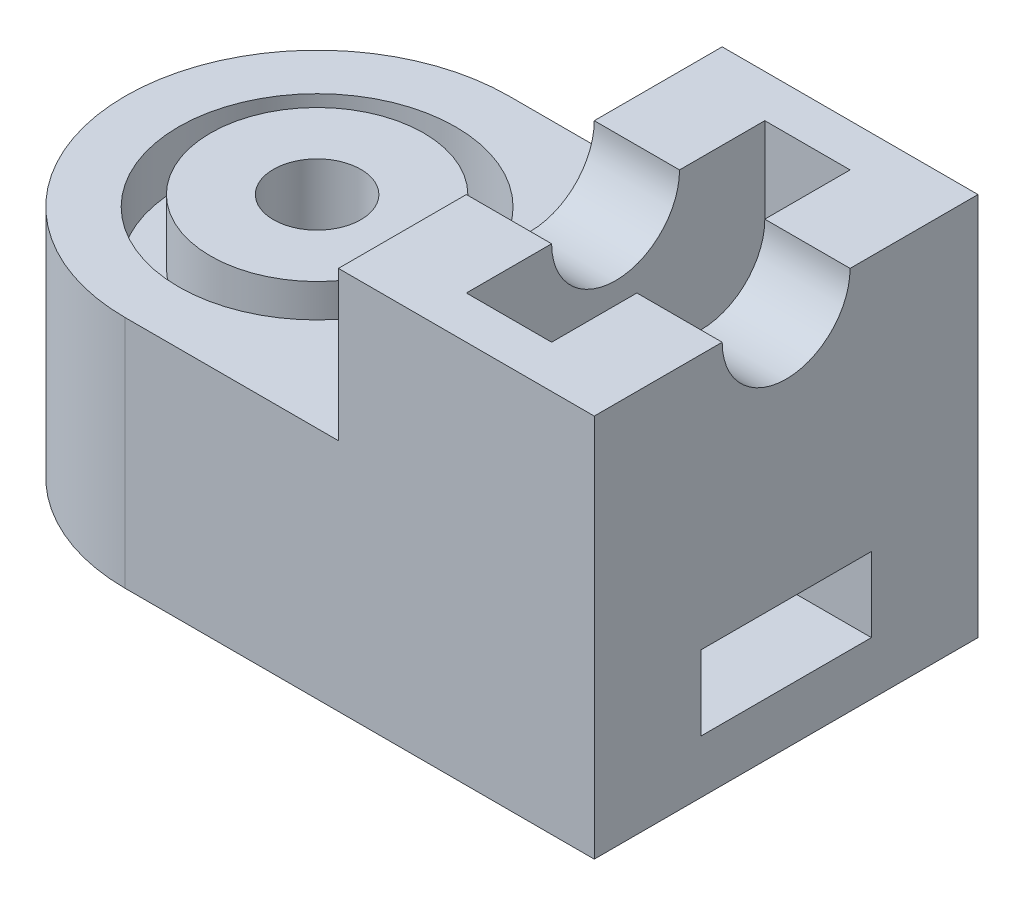
ISO-10303-21;
HEADER;
FILE_DESCRIPTION(('STEP AP214'),'2;1');
FILE_NAME('part.step','',(''),(''),'','','');
FILE_SCHEMA(('AUTOMOTIVE_DESIGN { 1 0 10303 214 1 1 1 1 }'));
ENDSEC;
DATA;
#1=APPLICATION_CONTEXT('core data for automotive mechanical design processes');
#2=APPLICATION_PROTOCOL_DEFINITION('international standard','automotive_design',2000,#1);
#3=PRODUCT_CONTEXT('',#1,'mechanical');
#4=PRODUCT('Part','Part','',(#3));
#5=PRODUCT_RELATED_PRODUCT_CATEGORY('part','',(#4));
#6=PRODUCT_DEFINITION_FORMATION('','',#4);
#7=PRODUCT_DEFINITION_CONTEXT('part definition',#1,'design');
#8=PRODUCT_DEFINITION('design','',#6,#7);
#9=PRODUCT_DEFINITION_SHAPE('','',#8);
#10=(LENGTH_UNIT() NAMED_UNIT(*) SI_UNIT(.MILLI.,.METRE.));
#11=(NAMED_UNIT(*) PLANE_ANGLE_UNIT() SI_UNIT($,.RADIAN.));
#12=(NAMED_UNIT(*) SI_UNIT($,.STERADIAN.) SOLID_ANGLE_UNIT());
#13=UNCERTAINTY_MEASURE_WITH_UNIT(LENGTH_MEASURE(1.E-05),#10,'distance_accuracy_value','');
#14=(GEOMETRIC_REPRESENTATION_CONTEXT(3) GLOBAL_UNCERTAINTY_ASSIGNED_CONTEXT((#13)) GLOBAL_UNIT_ASSIGNED_CONTEXT((#10,
#11,#12)) REPRESENTATION_CONTEXT('',''));
#15=CARTESIAN_POINT('',(0.,0.,0.));
#16=DIRECTION('',(0.,0.,1.));
#17=DIRECTION('',(1.,0.,0.));
#18=AXIS2_PLACEMENT_3D('',#15,#16,#17);
#19=CARTESIAN_POINT('',(-5.5,9.,0.));
#20=DIRECTION('',(0.,-1.,0.));
#21=DIRECTION('',(0.,0.,-1.));
#22=AXIS2_PLACEMENT_3D('',#19,#20,#21);
#23=CYLINDRICAL_SURFACE('',#22,4.5);
#24=DIRECTION('',(0.,-1.,0.));
#25=VECTOR('',#24,1.);
#26=CARTESIAN_POINT('',(-5.5,9.,4.5));
#27=LINE('',#26,#25);
#28=CARTESIAN_POINT('',(-5.5,5.5,4.5));
#29=VERTEX_POINT('',#28);
#30=CARTESIAN_POINT('',(-5.5,0.,4.5));
#31=VERTEX_POINT('',#30);
#32=EDGE_CURVE('E390',#29,#31,#27,.T.);
#33=ORIENTED_EDGE('',*,*,#32,.F.);
#34=CARTESIAN_POINT('',(-5.5,5.5,0.));
#35=DIRECTION('',(0.,-1.,0.));
#36=DIRECTION('',(0.,0.,-1.));
#37=AXIS2_PLACEMENT_3D('',#34,#35,#36);
#38=CIRCLE('',#37,4.5);
#39=CARTESIAN_POINT('',(-5.5,5.5,-4.5));
#40=VERTEX_POINT('',#39);
#41=EDGE_CURVE('E360',#29,#40,#38,.T.);
#42=ORIENTED_EDGE('',*,*,#41,.T.);
#43=DIRECTION('',(0.,-1.,0.));
#44=VECTOR('',#43,1.);
#45=CARTESIAN_POINT('',(-5.5,9.,-4.5));
#46=LINE('',#45,#44);
#47=CARTESIAN_POINT('',(-5.5,0.,-4.5));
#48=VERTEX_POINT('',#47);
#49=EDGE_CURVE('E374',#40,#48,#46,.T.);
#50=ORIENTED_EDGE('',*,*,#49,.T.);
#51=CARTESIAN_POINT('',(-5.5,0.,0.));
#52=DIRECTION('',(0.,1.,0.));
#53=DIRECTION('',(0.,0.,1.));
#54=AXIS2_PLACEMENT_3D('',#51,#52,#53);
#55=CIRCLE('',#54,4.5);
#56=EDGE_CURVE('E363',#48,#31,#55,.T.);
#57=ORIENTED_EDGE('',*,*,#56,.T.);
#58=EDGE_LOOP('',(#33,#42,#50,#57));
#59=FACE_BOUND('',#58,.T.);
#60=CARTESIAN_POINT('',(-5.5,0.750000000000001,0.));
#61=DIRECTION('',(0.,1.,0.));
#62=DIRECTION('',(0.,0.,1.));
#63=AXIS2_PLACEMENT_3D('',#60,#61,#62);
#64=CIRCLE('',#63,4.5);
#65=CARTESIAN_POINT('',(-8.85410196624968,0.75,-3.));
#66=VERTEX_POINT('',#65);
#67=CARTESIAN_POINT('',(-8.85410196624968,0.750000000000001,3.));
#68=VERTEX_POINT('',#67);
#69=EDGE_CURVE('E422',#66,#68,#64,.T.);
#70=ORIENTED_EDGE('',*,*,#69,.F.);
#71=DIRECTION('',(0.,-1.,0.));
#72=VECTOR('',#71,1.);
#73=CARTESIAN_POINT('',(-8.85410196624968,9.,-3.));
#74=LINE('',#73,#72);
#75=CARTESIAN_POINT('',(-8.85410196624968,3.5,-3.));
#76=VERTEX_POINT('',#75);
#77=EDGE_CURVE('E42',#76,#66,#74,.T.);
#78=ORIENTED_EDGE('',*,*,#77,.F.);
#79=CARTESIAN_POINT('',(-5.5,3.5,0.));
#80=DIRECTION('',(0.,-1.,0.));
#81=DIRECTION('',(0.,0.,-1.));
#82=AXIS2_PLACEMENT_3D('',#79,#80,#81);
#83=CIRCLE('',#82,4.5);
#84=CARTESIAN_POINT('',(-8.85410196624968,3.5,3.));
#85=VERTEX_POINT('',#84);
#86=EDGE_CURVE('E426',#85,#76,#83,.T.);
#87=ORIENTED_EDGE('',*,*,#86,.F.);
#88=DIRECTION('',(0.,-1.,0.));
#89=VECTOR('',#88,1.);
#90=CARTESIAN_POINT('',(-8.85410196624968,9.,3.));
#91=LINE('',#90,#89);
#92=EDGE_CURVE('E424',#68,#85,#91,.F.);
#93=ORIENTED_EDGE('',*,*,#92,.F.);
#94=EDGE_LOOP('',(#70,#78,#87,#93));
#95=FACE_BOUND('',#94,.T.);
#96=ADVANCED_FACE('F35',(#59,#95),#23,.T.);
#97=CARTESIAN_POINT('',(-16.,3.,-2.));
#98=DIRECTION('',(0.,1.,0.));
#99=DIRECTION('',(0.,0.,1.));
#100=AXIS2_PLACEMENT_3D('',#97,#98,#99);
#101=PLANE('',#100);
#102=DIRECTION('',(1.,0.,0.));
#103=VECTOR('',#102,1.);
#104=CARTESIAN_POINT('',(-16.,3.,-2.));
#105=LINE('',#104,#103);
#106=CARTESIAN_POINT('',(-5.5,3.,-2.));
#107=VERTEX_POINT('',#106);
#108=CARTESIAN_POINT('',(1.5,3.,-2.));
#109=VERTEX_POINT('',#108);
#110=EDGE_CURVE('E280',#107,#109,#105,.T.);
#111=ORIENTED_EDGE('',*,*,#110,.T.);
#112=DIRECTION('',(0.,0.,-1.));
#113=VECTOR('',#112,1.);
#114=CARTESIAN_POINT('',(1.5,3.,-3.5));
#115=LINE('',#114,#113);
#116=CARTESIAN_POINT('',(1.5,3.,2.));
#117=VERTEX_POINT('',#116);
#118=EDGE_CURVE('E408',#117,#109,#115,.T.);
#119=ORIENTED_EDGE('',*,*,#118,.F.);
#120=DIRECTION('',(1.,0.,0.));
#121=VECTOR('',#120,1.);
#122=CARTESIAN_POINT('',(-16.,3.,2.));
#123=LINE('',#122,#121);
#124=CARTESIAN_POINT('',(-5.5,3.,2.));
#125=VERTEX_POINT('',#124);
#126=EDGE_CURVE('E277',#125,#117,#123,.T.);
#127=ORIENTED_EDGE('',*,*,#126,.F.);
#128=DIRECTION('',(0.,0.,1.));
#129=VECTOR('',#128,1.);
#130=CARTESIAN_POINT('',(-5.5,3.,-2.));
#131=LINE('',#130,#129);
#132=EDGE_CURVE('E257',#107,#125,#131,.T.);
#133=ORIENTED_EDGE('',*,*,#132,.F.);
#134=EDGE_LOOP('',(#111,#119,#127,#133));
#135=FACE_BOUND('',#134,.T.);
#136=ADVANCED_FACE('F442',(#135),#101,.F.);
#137=CARTESIAN_POINT('',(-16.,1.25,2.));
#138=DIRECTION('',(0.,0.,1.));
#139=DIRECTION('',(0.,-1.,0.));
#140=AXIS2_PLACEMENT_3D('',#137,#138,#139);
#141=PLANE('',#140);
#142=ORIENTED_EDGE('',*,*,#126,.T.);
#143=DIRECTION('',(0.,1.,0.));
#144=VECTOR('',#143,1.);
#145=CARTESIAN_POINT('',(1.5,-19.7739735867457,2.));
#146=LINE('',#145,#144);
#147=CARTESIAN_POINT('',(1.5,1.25,2.));
#148=VERTEX_POINT('',#147);
#149=EDGE_CURVE('E411',#148,#117,#146,.T.);
#150=ORIENTED_EDGE('',*,*,#149,.F.);
#151=DIRECTION('',(1.,0.,0.));
#152=VECTOR('',#151,1.);
#153=CARTESIAN_POINT('',(-16.,1.25,2.));
#154=LINE('',#153,#152);
#155=CARTESIAN_POINT('',(-5.5,1.25,2.));
#156=VERTEX_POINT('',#155);
#157=EDGE_CURVE('E274',#156,#148,#154,.T.);
#158=ORIENTED_EDGE('',*,*,#157,.F.);
#159=DIRECTION('',(0.,-1.,0.));
#160=VECTOR('',#159,1.);
#161=CARTESIAN_POINT('',(-5.5,1.25,2.));
#162=LINE('',#161,#160);
#163=EDGE_CURVE('E255',#125,#156,#162,.T.);
#164=ORIENTED_EDGE('',*,*,#163,.F.);
#165=EDGE_LOOP('',(#142,#150,#158,#164));
#166=FACE_BOUND('',#165,.T.);
#167=ADVANCED_FACE('F449',(#166),#141,.F.);
#168=CARTESIAN_POINT('',(-16.,1.25,-2.));
#169=DIRECTION('',(0.,-1.,0.));
#170=DIRECTION('',(0.,0.,-1.));
#171=AXIS2_PLACEMENT_3D('',#168,#169,#170);
#172=PLANE('',#171);
#173=ORIENTED_EDGE('',*,*,#157,.T.);
#174=DIRECTION('',(0.,0.,1.));
#175=VECTOR('',#174,1.);
#176=CARTESIAN_POINT('',(1.5,1.25,-3.5));
#177=LINE('',#176,#175);
#178=CARTESIAN_POINT('',(1.5,1.25,-2.));
#179=VERTEX_POINT('',#178);
#180=EDGE_CURVE('E414',#179,#148,#177,.T.);
#181=ORIENTED_EDGE('',*,*,#180,.F.);
#182=DIRECTION('',(1.,0.,0.));
#183=VECTOR('',#182,1.);
#184=CARTESIAN_POINT('',(-16.,1.25,-2.));
#185=LINE('',#184,#183);
#186=CARTESIAN_POINT('',(-5.5,1.25,-2.));
#187=VERTEX_POINT('',#186);
#188=EDGE_CURVE('E273',#187,#179,#185,.T.);
#189=ORIENTED_EDGE('',*,*,#188,.F.);
#190=DIRECTION('',(0.,0.,-1.));
#191=VECTOR('',#190,1.);
#192=CARTESIAN_POINT('',(-5.5,1.25,-2.));
#193=LINE('',#192,#191);
#194=EDGE_CURVE('E55',#156,#187,#193,.T.);
#195=ORIENTED_EDGE('',*,*,#194,.F.);
#196=EDGE_LOOP('',(#173,#181,#189,#195));
#197=FACE_BOUND('',#196,.T.);
#198=ADVANCED_FACE('F543',(#197),#172,.F.);
#199=CARTESIAN_POINT('',(-16.,1.25,-2.));
#200=DIRECTION('',(0.,0.,-1.));
#201=DIRECTION('',(0.,1.,0.));
#202=AXIS2_PLACEMENT_3D('',#199,#200,#201);
#203=PLANE('',#202);
#204=ORIENTED_EDGE('',*,*,#188,.T.);
#205=DIRECTION('',(0.,-1.,0.));
#206=VECTOR('',#205,1.);
#207=CARTESIAN_POINT('',(1.5,-19.7739735867457,-2.00000000000001));
#208=LINE('',#207,#206);
#209=EDGE_CURVE('E417',#109,#179,#208,.T.);
#210=ORIENTED_EDGE('',*,*,#209,.F.);
#211=ORIENTED_EDGE('',*,*,#110,.F.);
#212=DIRECTION('',(0.,1.,0.));
#213=VECTOR('',#212,1.);
#214=CARTESIAN_POINT('',(-5.5,1.25,-2.));
#215=LINE('',#214,#213);
#216=EDGE_CURVE('E420',#187,#107,#215,.T.);
#217=ORIENTED_EDGE('',*,*,#216,.F.);
#218=EDGE_LOOP('',(#204,#210,#211,#217));
#219=FACE_BOUND('',#218,.T.);
#220=ADVANCED_FACE('F539',(#219),#203,.F.);
#221=CARTESIAN_POINT('',(13.,9.,0.));
#222=DIRECTION('',(-1.,0.,0.));
#223=DIRECTION('',(0.,0.,1.));
#224=AXIS2_PLACEMENT_3D('',#221,#222,#223);
#225=CYLINDRICAL_SURFACE('',#224,1.5);
#226=DIRECTION('',(-1.,0.,0.));
#227=VECTOR('',#226,1.);
#228=CARTESIAN_POINT('',(13.,9.,-1.5));
#229=LINE('',#228,#227);
#230=CARTESIAN_POINT('',(5.5,9.,-1.5));
#231=VERTEX_POINT('',#230);
#232=CARTESIAN_POINT('',(3.5,9.,-1.5));
#233=VERTEX_POINT('',#232);
#234=EDGE_CURVE('E337',#231,#233,#229,.T.);
#235=ORIENTED_EDGE('',*,*,#234,.T.);
#236=CARTESIAN_POINT('',(3.5,9.,0.));
#237=DIRECTION('',(1.,0.,0.));
#238=DIRECTION('',(0.,0.,-1.));
#239=AXIS2_PLACEMENT_3D('',#236,#237,#238);
#240=CIRCLE('',#239,1.5);
#241=CARTESIAN_POINT('',(3.5,9.,1.5));
#242=VERTEX_POINT('',#241);
#243=EDGE_CURVE('E399',#233,#242,#240,.F.);
#244=ORIENTED_EDGE('',*,*,#243,.T.);
#245=DIRECTION('',(-1.,0.,0.));
#246=VECTOR('',#245,1.);
#247=CARTESIAN_POINT('',(13.,9.,1.5));
#248=LINE('',#247,#246);
#249=CARTESIAN_POINT('',(5.5,9.,1.5));
#250=VERTEX_POINT('',#249);
#251=EDGE_CURVE('E342',#250,#242,#248,.T.);
#252=ORIENTED_EDGE('',*,*,#251,.F.);
#253=CARTESIAN_POINT('',(5.5,9.,0.));
#254=DIRECTION('',(-1.,0.,0.));
#255=DIRECTION('',(0.,0.,1.));
#256=AXIS2_PLACEMENT_3D('',#253,#254,#255);
#257=CIRCLE('',#256,1.5);
#258=EDGE_CURVE('E340',#231,#250,#257,.T.);
#259=ORIENTED_EDGE('',*,*,#258,.F.);
#260=EDGE_LOOP('',(#235,#244,#252,#259));
#261=FACE_BOUND('',#260,.T.);
#262=ADVANCED_FACE('F494',(#261),#225,.F.);
#263=CARTESIAN_POINT('',(0.,9.,0.));
#264=DIRECTION('',(0.,1.,0.));
#265=DIRECTION('',(0.,0.,1.));
#266=AXIS2_PLACEMENT_3D('',#263,#264,#265);
#267=PLANE('',#266);
#268=DIRECTION('',(0.,0.,-1.));
#269=VECTOR('',#268,1.);
#270=CARTESIAN_POINT('',(3.5,9.,-3.5));
#271=LINE('',#270,#269);
#272=CARTESIAN_POINT('',(3.5,9.,-3.5));
#273=VERTEX_POINT('',#272);
#274=EDGE_CURVE('E305',#233,#273,#271,.T.);
#275=ORIENTED_EDGE('',*,*,#274,.F.);
#276=ORIENTED_EDGE('',*,*,#234,.F.);
#277=DIRECTION('',(0.,0.,-1.));
#278=VECTOR('',#277,1.);
#279=CARTESIAN_POINT('',(5.5,9.,0.));
#280=LINE('',#279,#278);
#281=CARTESIAN_POINT('',(5.5,9.,-4.5));
#282=VERTEX_POINT('',#281);
#283=EDGE_CURVE('E366',#231,#282,#280,.T.);
#284=ORIENTED_EDGE('',*,*,#283,.T.);
#285=DIRECTION('',(1.,0.,0.));
#286=VECTOR('',#285,1.);
#287=CARTESIAN_POINT('',(0.,9.,-4.5));
#288=LINE('',#287,#286);
#289=CARTESIAN_POINT('',(-0.500000000000002,9.,-4.5));
#290=VERTEX_POINT('',#289);
#291=EDGE_CURVE('E371',#290,#282,#288,.T.);
#292=ORIENTED_EDGE('',*,*,#291,.F.);
#293=DIRECTION('',(0.,0.,-1.));
#294=VECTOR('',#293,1.);
#295=CARTESIAN_POINT('',(-0.500000000000002,9.,0.));
#296=LINE('',#295,#294);
#297=CARTESIAN_POINT('',(-0.500000000000002,9.,-1.5));
#298=VERTEX_POINT('',#297);
#299=EDGE_CURVE('E392',#298,#290,#296,.T.);
#300=ORIENTED_EDGE('',*,*,#299,.F.);
#301=CARTESIAN_POINT('',(1.5,9.,-1.5));
#302=VERTEX_POINT('',#301);
#303=EDGE_CURVE('E341',#302,#298,#229,.T.);
#304=ORIENTED_EDGE('',*,*,#303,.F.);
#305=DIRECTION('',(0.,0.,1.));
#306=VECTOR('',#305,1.);
#307=CARTESIAN_POINT('',(1.5,9.,-3.5));
#308=LINE('',#307,#306);
#309=CARTESIAN_POINT('',(1.5,9.,-3.5));
#310=VERTEX_POINT('',#309);
#311=EDGE_CURVE('E314',#310,#302,#308,.T.);
#312=ORIENTED_EDGE('',*,*,#311,.F.);
#313=DIRECTION('',(-1.,0.,0.));
#314=VECTOR('',#313,1.);
#315=CARTESIAN_POINT('',(3.5,9.,-3.5));
#316=LINE('',#315,#314);
#317=EDGE_CURVE('E310',#273,#310,#316,.T.);
#318=ORIENTED_EDGE('',*,*,#317,.F.);
#319=EDGE_LOOP('',(#275,#276,#284,#292,#300,#304,#312,#318));
#320=FACE_BOUND('',#319,.T.);
#321=ADVANCED_FACE('F490',(#320),#267,.T.);
#322=CARTESIAN_POINT('',(0.,9.,4.5));
#323=DIRECTION('',(0.,0.,-1.));
#324=DIRECTION('',(-1.,0.,0.));
#325=AXIS2_PLACEMENT_3D('',#322,#323,#324);
#326=PLANE('',#325);
#327=DIRECTION('',(1.,0.,0.));
#328=VECTOR('',#327,1.);
#329=CARTESIAN_POINT('',(0.,9.,4.5));
#330=LINE('',#329,#328);
#331=CARTESIAN_POINT('',(-0.500000000000002,9.,4.5));
#332=VERTEX_POINT('',#331);
#333=CARTESIAN_POINT('',(5.5,9.,4.5));
#334=VERTEX_POINT('',#333);
#335=EDGE_CURVE('E364',#332,#334,#330,.T.);
#336=ORIENTED_EDGE('',*,*,#335,.F.);
#337=DIRECTION('',(0.,-1.,0.));
#338=VECTOR('',#337,1.);
#339=CARTESIAN_POINT('',(-0.500000000000001,9.,4.5));
#340=LINE('',#339,#338);
#341=CARTESIAN_POINT('',(-0.500000000000001,5.5,4.5));
#342=VERTEX_POINT('',#341);
#343=EDGE_CURVE('E354',#332,#342,#340,.T.);
#344=ORIENTED_EDGE('',*,*,#343,.T.);
#345=DIRECTION('',(-1.,0.,0.));
#346=VECTOR('',#345,1.);
#347=CARTESIAN_POINT('',(0.,5.5,4.5));
#348=LINE('',#347,#346);
#349=EDGE_CURVE('E357',#342,#29,#348,.T.);
#350=ORIENTED_EDGE('',*,*,#349,.T.);
#351=ORIENTED_EDGE('',*,*,#32,.T.);
#352=DIRECTION('',(1.,0.,0.));
#353=VECTOR('',#352,1.);
#354=CARTESIAN_POINT('',(0.,0.,4.5));
#355=LINE('',#354,#353);
#356=CARTESIAN_POINT('',(5.5,0.,4.5));
#357=VERTEX_POINT('',#356);
#358=EDGE_CURVE('E377',#31,#357,#355,.T.);
#359=ORIENTED_EDGE('',*,*,#358,.T.);
#360=DIRECTION('',(0.,-1.,0.));
#361=VECTOR('',#360,1.);
#362=CARTESIAN_POINT('',(5.5,9.,4.5));
#363=LINE('',#362,#361);
#364=EDGE_CURVE('E387',#334,#357,#363,.T.);
#365=ORIENTED_EDGE('',*,*,#364,.F.);
#366=EDGE_LOOP('',(#336,#344,#350,#351,#359,#365));
#367=FACE_BOUND('',#366,.T.);
#368=ADVANCED_FACE('F459',(#367),#326,.F.);
#369=CARTESIAN_POINT('',(5.5,9.,0.));
#370=DIRECTION('',(-1.,0.,0.));
#371=DIRECTION('',(0.,0.,1.));
#372=AXIS2_PLACEMENT_3D('',#369,#370,#371);
#373=PLANE('',#372);
#374=DIRECTION('',(0.,0.,1.));
#375=VECTOR('',#374,1.);
#376=CARTESIAN_POINT('',(5.5,3.,-2.));
#377=LINE('',#376,#375);
#378=CARTESIAN_POINT('',(5.5,3.,-2.));
#379=VERTEX_POINT('',#378);
#380=CARTESIAN_POINT('',(5.5,3.,2.));
#381=VERTEX_POINT('',#380);
#382=EDGE_CURVE('E261',#379,#381,#377,.T.);
#383=ORIENTED_EDGE('',*,*,#382,.F.);
#384=DIRECTION('',(0.,1.,0.));
#385=VECTOR('',#384,1.);
#386=CARTESIAN_POINT('',(5.5,1.25,-2.));
#387=LINE('',#386,#385);
#388=CARTESIAN_POINT('',(5.5,1.25,-2.));
#389=VERTEX_POINT('',#388);
#390=EDGE_CURVE('E259',#389,#379,#387,.T.);
#391=ORIENTED_EDGE('',*,*,#390,.F.);
#392=DIRECTION('',(0.,0.,-1.));
#393=VECTOR('',#392,1.);
#394=CARTESIAN_POINT('',(5.5,1.25,-2.));
#395=LINE('',#394,#393);
#396=CARTESIAN_POINT('',(5.5,1.25,2.));
#397=VERTEX_POINT('',#396);
#398=EDGE_CURVE('E267',#397,#389,#395,.T.);
#399=ORIENTED_EDGE('',*,*,#398,.F.);
#400=DIRECTION('',(0.,-1.,0.));
#401=VECTOR('',#400,1.);
#402=CARTESIAN_POINT('',(5.5,1.25,2.));
#403=LINE('',#402,#401);
#404=EDGE_CURVE('E264',#381,#397,#403,.T.);
#405=ORIENTED_EDGE('',*,*,#404,.F.);
#406=EDGE_LOOP('',(#383,#391,#399,#405));
#407=FACE_BOUND('',#406,.T.);
#408=ORIENTED_EDGE('',*,*,#283,.F.);
#409=ORIENTED_EDGE('',*,*,#258,.T.);
#410=EDGE_CURVE('E368',#334,#250,#280,.T.);
#411=ORIENTED_EDGE('',*,*,#410,.F.);
#412=ORIENTED_EDGE('',*,*,#364,.T.);
#413=DIRECTION('',(0.,0.,-1.));
#414=VECTOR('',#413,1.);
#415=CARTESIAN_POINT('',(5.5,0.,0.));
#416=LINE('',#415,#414);
#417=CARTESIAN_POINT('',(5.5,0.,-4.5));
#418=VERTEX_POINT('',#417);
#419=EDGE_CURVE('E379',#357,#418,#416,.T.);
#420=ORIENTED_EDGE('',*,*,#419,.T.);
#421=DIRECTION('',(0.,-1.,0.));
#422=VECTOR('',#421,1.);
#423=CARTESIAN_POINT('',(5.5,9.,-4.5));
#424=LINE('',#423,#422);
#425=EDGE_CURVE('E385',#282,#418,#424,.T.);
#426=ORIENTED_EDGE('',*,*,#425,.F.);
#427=EDGE_LOOP('',(#408,#409,#411,#412,#420,#426));
#428=FACE_BOUND('',#427,.T.);
#429=ADVANCED_FACE('F468',(#407,#428),#373,.F.);
#430=CARTESIAN_POINT('',(0.,9.,-4.5));
#431=DIRECTION('',(0.,0.,-1.));
#432=DIRECTION('',(-1.,0.,0.));
#433=AXIS2_PLACEMENT_3D('',#430,#431,#432);
#434=PLANE('',#433);
#435=DIRECTION('',(0.,1.,0.));
#436=VECTOR('',#435,1.);
#437=CARTESIAN_POINT('',(-0.500000000000002,5.5,-4.5));
#438=LINE('',#437,#436);
#439=CARTESIAN_POINT('',(-0.500000000000002,5.5,-4.5));
#440=VERTEX_POINT('',#439);
#441=EDGE_CURVE('E351',#440,#290,#438,.T.);
#442=ORIENTED_EDGE('',*,*,#441,.T.);
#443=ORIENTED_EDGE('',*,*,#291,.T.);
#444=ORIENTED_EDGE('',*,*,#425,.T.);
#445=DIRECTION('',(1.,0.,0.));
#446=VECTOR('',#445,1.);
#447=CARTESIAN_POINT('',(0.,0.,-4.5));
#448=LINE('',#447,#446);
#449=EDGE_CURVE('E367',#48,#418,#448,.T.);
#450=ORIENTED_EDGE('',*,*,#449,.F.);
#451=ORIENTED_EDGE('',*,*,#49,.F.);
#452=DIRECTION('',(-1.,0.,0.));
#453=VECTOR('',#452,1.);
#454=CARTESIAN_POINT('',(-0.500000000000002,5.5,-4.5));
#455=LINE('',#454,#453);
#456=EDGE_CURVE('E349',#440,#40,#455,.T.);
#457=ORIENTED_EDGE('',*,*,#456,.F.);
#458=EDGE_LOOP('',(#442,#443,#444,#450,#451,#457));
#459=FACE_BOUND('',#458,.T.);
#460=ADVANCED_FACE('F486',(#459),#434,.T.);
#461=CARTESIAN_POINT('',(3.5,9.,3.5));
#462=VERTEX_POINT('',#461);
#463=EDGE_CURVE('E308',#462,#242,#271,.T.);
#464=ORIENTED_EDGE('',*,*,#463,.F.);
#465=DIRECTION('',(1.,0.,0.));
#466=VECTOR('',#465,1.);
#467=CARTESIAN_POINT('',(3.5,9.,3.5));
#468=LINE('',#467,#466);
#469=CARTESIAN_POINT('',(1.5,9.,3.5));
#470=VERTEX_POINT('',#469);
#471=EDGE_CURVE('E316',#470,#462,#468,.T.);
#472=ORIENTED_EDGE('',*,*,#471,.F.);
#473=CARTESIAN_POINT('',(1.5,9.,1.5));
#474=VERTEX_POINT('',#473);
#475=EDGE_CURVE('E313',#474,#470,#308,.T.);
#476=ORIENTED_EDGE('',*,*,#475,.F.);
#477=CARTESIAN_POINT('',(-0.500000000000001,9.,1.5));
#478=VERTEX_POINT('',#477);
#479=EDGE_CURVE('E336',#474,#478,#248,.T.);
#480=ORIENTED_EDGE('',*,*,#479,.T.);
#481=EDGE_CURVE('E393',#332,#478,#296,.T.);
#482=ORIENTED_EDGE('',*,*,#481,.F.);
#483=ORIENTED_EDGE('',*,*,#335,.T.);
#484=ORIENTED_EDGE('',*,*,#410,.T.);
#485=ORIENTED_EDGE('',*,*,#251,.T.);
#486=EDGE_LOOP('',(#464,#472,#476,#480,#482,#483,#484,#485));
#487=FACE_BOUND('',#486,.T.);
#488=ADVANCED_FACE('F473',(#487),#267,.T.);
#489=CARTESIAN_POINT('',(0.,0.,0.));
#490=DIRECTION('',(0.,1.,0.));
#491=DIRECTION('',(0.,0.,1.));
#492=AXIS2_PLACEMENT_3D('',#489,#490,#491);
#493=PLANE('',#492);
#494=DIRECTION('',(1.,0.,0.));
#495=VECTOR('',#494,1.);
#496=CARTESIAN_POINT('',(0.,0.,3.5));
#497=LINE('',#496,#495);
#498=CARTESIAN_POINT('',(1.5,0.,3.5));
#499=VERTEX_POINT('',#498);
#500=CARTESIAN_POINT('',(3.5,0.,3.5));
#501=VERTEX_POINT('',#500);
#502=EDGE_CURVE('E405',#499,#501,#497,.T.);
#503=ORIENTED_EDGE('',*,*,#502,.T.);
#504=DIRECTION('',(0.,0.,-1.));
#505=VECTOR('',#504,1.);
#506=CARTESIAN_POINT('',(3.5,0.,0.));
#507=LINE('',#506,#505);
#508=CARTESIAN_POINT('',(3.5,0.,-3.5));
#509=VERTEX_POINT('',#508);
#510=EDGE_CURVE('E330',#501,#509,#507,.T.);
#511=ORIENTED_EDGE('',*,*,#510,.T.);
#512=DIRECTION('',(-1.,0.,0.));
#513=VECTOR('',#512,1.);
#514=CARTESIAN_POINT('',(0.,0.,-3.5));
#515=LINE('',#514,#513);
#516=CARTESIAN_POINT('',(1.5,0.,-3.5));
#517=VERTEX_POINT('',#516);
#518=EDGE_CURVE('E402',#509,#517,#515,.T.);
#519=ORIENTED_EDGE('',*,*,#518,.T.);
#520=DIRECTION('',(0.,0.,1.));
#521=VECTOR('',#520,1.);
#522=CARTESIAN_POINT('',(1.5,0.,0.));
#523=LINE('',#522,#521);
#524=EDGE_CURVE('E322',#517,#499,#523,.T.);
#525=ORIENTED_EDGE('',*,*,#524,.T.);
#526=EDGE_LOOP('',(#503,#511,#519,#525));
#527=FACE_BOUND('',#526,.T.);
#528=ORIENTED_EDGE('',*,*,#56,.F.);
#529=ORIENTED_EDGE('',*,*,#449,.T.);
#530=ORIENTED_EDGE('',*,*,#419,.F.);
#531=ORIENTED_EDGE('',*,*,#358,.F.);
#532=EDGE_LOOP('',(#528,#529,#530,#531));
#533=FACE_BOUND('',#532,.T.);
#534=ADVANCED_FACE('F463',(#527,#533),#493,.F.);
#535=CARTESIAN_POINT('',(0.,5.5,0.));
#536=DIRECTION('',(0.,-1.,0.));
#537=DIRECTION('',(0.,0.,-1.));
#538=AXIS2_PLACEMENT_3D('',#535,#536,#537);
#539=PLANE('',#538);
#540=CARTESIAN_POINT('',(-5.5,5.5,0.));
#541=DIRECTION('',(0.,1.,0.));
#542=DIRECTION('',(0.,0.,1.));
#543=AXIS2_PLACEMENT_3D('',#540,#541,#542);
#544=CIRCLE('',#543,3.25);
#545=CARTESIAN_POINT('',(-5.5,5.5,3.25));
#546=VERTEX_POINT('',#545);
#547=EDGE_CURVE('E299',#546,#546,#544,.T.);
#548=ORIENTED_EDGE('',*,*,#547,.F.);
#549=EDGE_LOOP('',(#548));
#550=FACE_BOUND('',#549,.T.);
#551=ORIENTED_EDGE('',*,*,#349,.F.);
#552=DIRECTION('',(0.,0.,-1.));
#553=VECTOR('',#552,1.);
#554=CARTESIAN_POINT('',(-0.500000000000002,5.5,-4.5));
#555=LINE('',#554,#553);
#556=EDGE_CURVE('E347',#342,#440,#555,.T.);
#557=ORIENTED_EDGE('',*,*,#556,.T.);
#558=ORIENTED_EDGE('',*,*,#456,.T.);
#559=ORIENTED_EDGE('',*,*,#41,.F.);
#560=EDGE_LOOP('',(#551,#557,#558,#559));
#561=FACE_BOUND('',#560,.T.);
#562=ADVANCED_FACE('F484',(#550,#561),#539,.F.);
#563=CARTESIAN_POINT('',(-0.500000000000002,5.5,-4.5));
#564=DIRECTION('',(1.,0.,0.));
#565=DIRECTION('',(0.,0.,-1.));
#566=AXIS2_PLACEMENT_3D('',#563,#564,#565);
#567=PLANE('',#566);
#568=ORIENTED_EDGE('',*,*,#481,.T.);
#569=CARTESIAN_POINT('',(-0.500000000000002,9.,0.));
#570=DIRECTION('',(-1.,0.,0.));
#571=DIRECTION('',(0.,0.,1.));
#572=AXIS2_PLACEMENT_3D('',#569,#570,#571);
#573=CIRCLE('',#572,1.5);
#574=EDGE_CURVE('E333',#298,#478,#573,.T.);
#575=ORIENTED_EDGE('',*,*,#574,.F.);
#576=ORIENTED_EDGE('',*,*,#299,.T.);
#577=ORIENTED_EDGE('',*,*,#441,.F.);
#578=ORIENTED_EDGE('',*,*,#556,.F.);
#579=ORIENTED_EDGE('',*,*,#343,.F.);
#580=EDGE_LOOP('',(#568,#575,#576,#577,#578,#579));
#581=FACE_BOUND('',#580,.T.);
#582=ADVANCED_FACE('F478',(#581),#567,.F.);
#583=ORIENTED_EDGE('',*,*,#479,.F.);
#584=CARTESIAN_POINT('',(1.5,9.,0.));
#585=DIRECTION('',(-1.,0.,0.));
#586=DIRECTION('',(0.,0.,1.));
#587=AXIS2_PLACEMENT_3D('',#584,#585,#586);
#588=CIRCLE('',#587,1.5);
#589=EDGE_CURVE('E396',#474,#302,#588,.F.);
#590=ORIENTED_EDGE('',*,*,#589,.T.);
#591=ORIENTED_EDGE('',*,*,#303,.T.);
#592=ORIENTED_EDGE('',*,*,#574,.T.);
#593=EDGE_LOOP('',(#583,#590,#591,#592));
#594=FACE_BOUND('',#593,.T.);
#595=ADVANCED_FACE('F509',(#594),#225,.F.);
#596=CARTESIAN_POINT('',(3.5,-19.7739735867457,3.5));
#597=DIRECTION('',(0.,0.,1.));
#598=DIRECTION('',(1.,0.,0.));
#599=AXIS2_PLACEMENT_3D('',#596,#597,#598);
#600=PLANE('',#599);
#601=DIRECTION('',(0.,1.,0.));
#602=VECTOR('',#601,1.);
#603=CARTESIAN_POINT('',(1.5,-19.7739735867457,3.5));
#604=LINE('',#603,#602);
#605=EDGE_CURVE('E323',#499,#470,#604,.T.);
#606=ORIENTED_EDGE('',*,*,#605,.T.);
#607=ORIENTED_EDGE('',*,*,#471,.T.);
#608=DIRECTION('',(0.,1.,0.));
#609=VECTOR('',#608,1.);
#610=CARTESIAN_POINT('',(3.5,-19.7739735867457,3.5));
#611=LINE('',#610,#609);
#612=EDGE_CURVE('E320',#501,#462,#611,.T.);
#613=ORIENTED_EDGE('',*,*,#612,.F.);
#614=ORIENTED_EDGE('',*,*,#502,.F.);
#615=EDGE_LOOP('',(#606,#607,#613,#614));
#616=FACE_BOUND('',#615,.T.);
#617=ADVANCED_FACE('F502',(#616),#600,.F.);
#618=CARTESIAN_POINT('',(3.5,-19.7739735867457,-3.5));
#619=DIRECTION('',(0.,0.,-1.));
#620=DIRECTION('',(-1.,0.,0.));
#621=AXIS2_PLACEMENT_3D('',#618,#619,#620);
#622=PLANE('',#621);
#623=DIRECTION('',(0.,1.,0.));
#624=VECTOR('',#623,1.);
#625=CARTESIAN_POINT('',(3.5,-19.7739735867457,-3.5));
#626=LINE('',#625,#624);
#627=EDGE_CURVE('E319',#509,#273,#626,.T.);
#628=ORIENTED_EDGE('',*,*,#627,.T.);
#629=ORIENTED_EDGE('',*,*,#317,.T.);
#630=DIRECTION('',(0.,1.,0.));
#631=VECTOR('',#630,1.);
#632=CARTESIAN_POINT('',(1.5,-19.7739735867457,-3.5));
#633=LINE('',#632,#631);
#634=EDGE_CURVE('E325',#517,#310,#633,.T.);
#635=ORIENTED_EDGE('',*,*,#634,.F.);
#636=ORIENTED_EDGE('',*,*,#518,.F.);
#637=EDGE_LOOP('',(#628,#629,#635,#636));
#638=FACE_BOUND('',#637,.T.);
#639=ADVANCED_FACE('F513',(#638),#622,.F.);
#640=CARTESIAN_POINT('',(3.5,-19.7739735867457,-3.5));
#641=DIRECTION('',(1.,0.,0.));
#642=DIRECTION('',(0.,0.,-1.));
#643=AXIS2_PLACEMENT_3D('',#640,#641,#642);
#644=PLANE('',#643);
#645=DIRECTION('',(0.,0.,-1.));
#646=VECTOR('',#645,1.);
#647=CARTESIAN_POINT('',(3.5,1.25,-3.5));
#648=LINE('',#647,#646);
#649=CARTESIAN_POINT('',(3.5,1.25,2.));
#650=VERTEX_POINT('',#649);
#651=CARTESIAN_POINT('',(3.5,1.25,-2.));
#652=VERTEX_POINT('',#651);
#653=EDGE_CURVE('E289',#650,#652,#648,.T.);
#654=ORIENTED_EDGE('',*,*,#653,.T.);
#655=DIRECTION('',(0.,1.,0.));
#656=VECTOR('',#655,1.);
#657=CARTESIAN_POINT('',(3.5,-19.7739735867457,-2.00000000000001));
#658=LINE('',#657,#656);
#659=CARTESIAN_POINT('',(3.5,3.,-2.));
#660=VERTEX_POINT('',#659);
#661=EDGE_CURVE('E292',#652,#660,#658,.T.);
#662=ORIENTED_EDGE('',*,*,#661,.T.);
#663=DIRECTION('',(0.,0.,1.));
#664=VECTOR('',#663,1.);
#665=CARTESIAN_POINT('',(3.5,3.,-3.5));
#666=LINE('',#665,#664);
#667=CARTESIAN_POINT('',(3.5,3.,2.));
#668=VERTEX_POINT('',#667);
#669=EDGE_CURVE('E283',#660,#668,#666,.T.);
#670=ORIENTED_EDGE('',*,*,#669,.T.);
#671=DIRECTION('',(0.,-1.,0.));
#672=VECTOR('',#671,1.);
#673=CARTESIAN_POINT('',(3.5,-19.7739735867457,2.));
#674=LINE('',#673,#672);
#675=EDGE_CURVE('E286',#668,#650,#674,.T.);
#676=ORIENTED_EDGE('',*,*,#675,.T.);
#677=EDGE_LOOP('',(#654,#662,#670,#676));
#678=FACE_BOUND('',#677,.T.);
#679=ORIENTED_EDGE('',*,*,#612,.T.);
#680=ORIENTED_EDGE('',*,*,#463,.T.);
#681=ORIENTED_EDGE('',*,*,#243,.F.);
#682=ORIENTED_EDGE('',*,*,#274,.T.);
#683=ORIENTED_EDGE('',*,*,#627,.F.);
#684=ORIENTED_EDGE('',*,*,#510,.F.);
#685=EDGE_LOOP('',(#679,#680,#681,#682,#683,#684));
#686=FACE_BOUND('',#685,.T.);
#687=ADVANCED_FACE('F497',(#678,#686),#644,.F.);
#688=CARTESIAN_POINT('',(1.5,-19.7739735867457,-3.5));
#689=DIRECTION('',(-1.,0.,0.));
#690=DIRECTION('',(0.,0.,1.));
#691=AXIS2_PLACEMENT_3D('',#688,#689,#690);
#692=PLANE('',#691);
#693=ORIENTED_EDGE('',*,*,#118,.T.);
#694=ORIENTED_EDGE('',*,*,#209,.T.);
#695=ORIENTED_EDGE('',*,*,#180,.T.);
#696=ORIENTED_EDGE('',*,*,#149,.T.);
#697=EDGE_LOOP('',(#693,#694,#695,#696));
#698=FACE_BOUND('',#697,.T.);
#699=ORIENTED_EDGE('',*,*,#634,.T.);
#700=ORIENTED_EDGE('',*,*,#311,.T.);
#701=ORIENTED_EDGE('',*,*,#589,.F.);
#702=ORIENTED_EDGE('',*,*,#475,.T.);
#703=ORIENTED_EDGE('',*,*,#605,.F.);
#704=ORIENTED_EDGE('',*,*,#524,.F.);
#705=EDGE_LOOP('',(#699,#700,#701,#702,#703,#704));
#706=FACE_BOUND('',#705,.T.);
#707=ADVANCED_FACE('F507',(#698,#706),#692,.F.);
#708=CARTESIAN_POINT('',(-5.5,4.25,0.));
#709=DIRECTION('',(0.,1.,0.));
#710=DIRECTION('',(0.,0.,1.));
#711=AXIS2_PLACEMENT_3D('',#708,#709,#710);
#712=CYLINDRICAL_SURFACE('',#711,3.25);
#713=CARTESIAN_POINT('',(-5.5,4.25,0.));
#714=DIRECTION('',(0.,1.,0.));
#715=DIRECTION('',(0.,0.,1.));
#716=AXIS2_PLACEMENT_3D('',#713,#714,#715);
#717=CIRCLE('',#716,3.25);
#718=CARTESIAN_POINT('',(-5.5,4.25,3.25));
#719=VERTEX_POINT('',#718);
#720=EDGE_CURVE('E302',#719,#719,#717,.T.);
#721=ORIENTED_EDGE('',*,*,#720,.F.);
#722=EDGE_LOOP('',(#721));
#723=FACE_BOUND('',#722,.T.);
#724=ORIENTED_EDGE('',*,*,#547,.T.);
#725=EDGE_LOOP('',(#724));
#726=FACE_BOUND('',#725,.T.);
#727=ADVANCED_FACE('F570',(#723,#726),#712,.F.);
#728=CARTESIAN_POINT('',(-5.5,4.25,0.));
#729=DIRECTION('',(0.,1.,0.));
#730=DIRECTION('',(0.,0.,1.));
#731=AXIS2_PLACEMENT_3D('',#728,#729,#730);
#732=PLANE('',#731);
#733=CARTESIAN_POINT('',(-5.5,4.25,0.));
#734=DIRECTION('',(0.,1.,0.));
#735=DIRECTION('',(0.,0.,1.));
#736=AXIS2_PLACEMENT_3D('',#733,#734,#735);
#737=CIRCLE('',#736,2.5);
#738=CARTESIAN_POINT('',(-5.5,4.25,2.5));
#739=VERTEX_POINT('',#738);
#740=EDGE_CURVE('E295',#739,#739,#737,.T.);
#741=ORIENTED_EDGE('',*,*,#740,.F.);
#742=EDGE_LOOP('',(#741));
#743=FACE_BOUND('',#742,.T.);
#744=ORIENTED_EDGE('',*,*,#720,.T.);
#745=EDGE_LOOP('',(#744));
#746=FACE_BOUND('',#745,.T.);
#747=ADVANCED_FACE('F575',(#743,#746),#732,.T.);
#748=CARTESIAN_POINT('',(-5.5,5.75,0.));
#749=DIRECTION('',(0.,-1.,0.));
#750=DIRECTION('',(0.,0.,-1.));
#751=AXIS2_PLACEMENT_3D('',#748,#749,#750);
#752=CYLINDRICAL_SURFACE('',#751,2.5);
#753=CARTESIAN_POINT('',(-5.5,5.75,0.));
#754=DIRECTION('',(0.,1.,0.));
#755=DIRECTION('',(0.,0.,1.));
#756=AXIS2_PLACEMENT_3D('',#753,#754,#755);
#757=CIRCLE('',#756,2.5);
#758=CARTESIAN_POINT('',(-5.5,5.75,2.5));
#759=VERTEX_POINT('',#758);
#760=EDGE_CURVE('E296',#759,#759,#757,.T.);
#761=ORIENTED_EDGE('',*,*,#760,.F.);
#762=EDGE_LOOP('',(#761));
#763=FACE_BOUND('',#762,.T.);
#764=ORIENTED_EDGE('',*,*,#740,.T.);
#765=EDGE_LOOP('',(#764));
#766=FACE_BOUND('',#765,.T.);
#767=ADVANCED_FACE('F587',(#763,#766),#752,.T.);
#768=CARTESIAN_POINT('',(-5.5,5.75,0.));
#769=DIRECTION('',(0.,1.,0.));
#770=DIRECTION('',(0.,0.,1.));
#771=AXIS2_PLACEMENT_3D('',#768,#769,#770);
#772=PLANE('',#771);
#773=CARTESIAN_POINT('',(-5.5,5.75,0.));
#774=DIRECTION('',(0.,1.,0.));
#775=DIRECTION('',(0.,0.,1.));
#776=AXIS2_PLACEMENT_3D('',#773,#774,#775);
#777=CIRCLE('',#776,1.025);
#778=CARTESIAN_POINT('',(-5.5,5.75,1.025));
#779=VERTEX_POINT('',#778);
#780=EDGE_CURVE('E225',#779,#779,#777,.T.);
#781=ORIENTED_EDGE('',*,*,#780,.F.);
#782=EDGE_LOOP('',(#781));
#783=FACE_BOUND('',#782,.T.);
#784=ORIENTED_EDGE('',*,*,#760,.T.);
#785=EDGE_LOOP('',(#784));
#786=FACE_BOUND('',#785,.T.);
#787=ADVANCED_FACE('F596',(#783,#786),#772,.T.);
#788=EDGE_CURVE('E271',#652,#389,#185,.T.);
#789=ORIENTED_EDGE('',*,*,#788,.T.);
#790=ORIENTED_EDGE('',*,*,#390,.T.);
#791=EDGE_CURVE('E270',#660,#379,#105,.T.);
#792=ORIENTED_EDGE('',*,*,#791,.F.);
#793=ORIENTED_EDGE('',*,*,#661,.F.);
#794=EDGE_LOOP('',(#789,#790,#792,#793));
#795=FACE_BOUND('',#794,.T.);
#796=ADVANCED_FACE('F546',(#795),#203,.F.);
#797=EDGE_CURVE('E275',#650,#397,#154,.T.);
#798=ORIENTED_EDGE('',*,*,#797,.T.);
#799=ORIENTED_EDGE('',*,*,#398,.T.);
#800=ORIENTED_EDGE('',*,*,#788,.F.);
#801=ORIENTED_EDGE('',*,*,#653,.F.);
#802=EDGE_LOOP('',(#798,#799,#800,#801));
#803=FACE_BOUND('',#802,.T.);
#804=ADVANCED_FACE('F629',(#803),#172,.F.);
#805=EDGE_CURVE('E278',#668,#381,#123,.T.);
#806=ORIENTED_EDGE('',*,*,#805,.T.);
#807=ORIENTED_EDGE('',*,*,#404,.T.);
#808=ORIENTED_EDGE('',*,*,#797,.F.);
#809=ORIENTED_EDGE('',*,*,#675,.F.);
#810=EDGE_LOOP('',(#806,#807,#808,#809));
#811=FACE_BOUND('',#810,.T.);
#812=ADVANCED_FACE('F638',(#811),#141,.F.);
#813=ORIENTED_EDGE('',*,*,#791,.T.);
#814=ORIENTED_EDGE('',*,*,#382,.T.);
#815=ORIENTED_EDGE('',*,*,#805,.F.);
#816=ORIENTED_EDGE('',*,*,#669,.F.);
#817=EDGE_LOOP('',(#813,#814,#815,#816));
#818=FACE_BOUND('',#817,.T.);
#819=ADVANCED_FACE('F452',(#818),#101,.F.);
#820=CARTESIAN_POINT('',(-5.5,0.75,3.));
#821=DIRECTION('',(0.,0.,-1.));
#822=DIRECTION('',(-1.,0.,0.));
#823=AXIS2_PLACEMENT_3D('',#820,#821,#822);
#824=PLANE('',#823);
#825=ORIENTED_EDGE('',*,*,#92,.T.);
#826=DIRECTION('',(-1.,0.,0.));
#827=VECTOR('',#826,1.);
#828=CARTESIAN_POINT('',(-5.5,3.5,3.));
#829=LINE('',#828,#827);
#830=CARTESIAN_POINT('',(-5.5,3.5,3.));
#831=VERTEX_POINT('',#830);
#832=EDGE_CURVE('E243',#831,#85,#829,.T.);
#833=ORIENTED_EDGE('',*,*,#832,.F.);
#834=DIRECTION('',(0.,-1.,0.));
#835=VECTOR('',#834,1.);
#836=CARTESIAN_POINT('',(-5.5,0.75,3.));
#837=LINE('',#836,#835);
#838=CARTESIAN_POINT('',(-5.5,0.75,3.));
#839=VERTEX_POINT('',#838);
#840=EDGE_CURVE('E224',#831,#839,#837,.T.);
#841=ORIENTED_EDGE('',*,*,#840,.T.);
#842=DIRECTION('',(-1.,0.,0.));
#843=VECTOR('',#842,1.);
#844=CARTESIAN_POINT('',(-5.5,0.75,3.));
#845=LINE('',#844,#843);
#846=EDGE_CURVE('E251',#839,#68,#845,.T.);
#847=ORIENTED_EDGE('',*,*,#846,.T.);
#848=EDGE_LOOP('',(#825,#833,#841,#847));
#849=FACE_BOUND('',#848,.T.);
#850=ADVANCED_FACE('F439',(#849),#824,.T.);
#851=CARTESIAN_POINT('',(-5.5,0.75,3.));
#852=DIRECTION('',(0.,1.,0.));
#853=DIRECTION('',(0.,0.,1.));
#854=AXIS2_PLACEMENT_3D('',#851,#852,#853);
#855=PLANE('',#854);
#856=DIRECTION('',(-1.,0.,0.));
#857=VECTOR('',#856,1.);
#858=CARTESIAN_POINT('',(-5.5,0.75,-3.));
#859=LINE('',#858,#857);
#860=CARTESIAN_POINT('',(-5.5,0.75,-3.));
#861=VERTEX_POINT('',#860);
#862=EDGE_CURVE('E248',#861,#66,#859,.T.);
#863=ORIENTED_EDGE('',*,*,#862,.T.);
#864=ORIENTED_EDGE('',*,*,#69,.T.);
#865=ORIENTED_EDGE('',*,*,#846,.F.);
#866=DIRECTION('',(0.,0.,-1.));
#867=VECTOR('',#866,1.);
#868=CARTESIAN_POINT('',(-5.5,0.75,3.));
#869=LINE('',#868,#867);
#870=EDGE_CURVE('E240',#839,#861,#869,.T.);
#871=ORIENTED_EDGE('',*,*,#870,.T.);
#872=EDGE_LOOP('',(#863,#864,#865,#871));
#873=FACE_BOUND('',#872,.T.);
#874=ADVANCED_FACE('F436',(#873),#855,.T.);
#875=CARTESIAN_POINT('',(-5.5,0.75,-3.));
#876=DIRECTION('',(0.,0.,1.));
#877=DIRECTION('',(1.,0.,0.));
#878=AXIS2_PLACEMENT_3D('',#875,#876,#877);
#879=PLANE('',#878);
#880=ORIENTED_EDGE('',*,*,#77,.T.);
#881=ORIENTED_EDGE('',*,*,#862,.F.);
#882=DIRECTION('',(0.,1.,0.));
#883=VECTOR('',#882,1.);
#884=CARTESIAN_POINT('',(-5.5,0.75,-3.));
#885=LINE('',#884,#883);
#886=CARTESIAN_POINT('',(-5.5,3.5,-3.));
#887=VERTEX_POINT('',#886);
#888=EDGE_CURVE('E232',#861,#887,#885,.T.);
#889=ORIENTED_EDGE('',*,*,#888,.T.);
#890=DIRECTION('',(-1.,0.,0.));
#891=VECTOR('',#890,1.);
#892=CARTESIAN_POINT('',(-5.5,3.5,-3.));
#893=LINE('',#892,#891);
#894=EDGE_CURVE('E245',#887,#76,#893,.T.);
#895=ORIENTED_EDGE('',*,*,#894,.T.);
#896=EDGE_LOOP('',(#880,#881,#889,#895));
#897=FACE_BOUND('',#896,.T.);
#898=ADVANCED_FACE('F431',(#897),#879,.T.);
#899=CARTESIAN_POINT('',(-5.5,3.5,3.));
#900=DIRECTION('',(0.,-1.,0.));
#901=DIRECTION('',(0.,0.,-1.));
#902=AXIS2_PLACEMENT_3D('',#899,#900,#901);
#903=PLANE('',#902);
#904=CARTESIAN_POINT('',(-5.5,3.5,0.));
#905=DIRECTION('',(0.,-1.,0.));
#906=DIRECTION('',(0.,0.,-1.));
#907=AXIS2_PLACEMENT_3D('',#904,#905,#906);
#908=CIRCLE('',#907,1.025);
#909=CARTESIAN_POINT('',(-5.5,3.5,1.025));
#910=VERTEX_POINT('',#909);
#911=CARTESIAN_POINT('',(-5.5,3.5,-1.025));
#912=VERTEX_POINT('',#911);
#913=EDGE_CURVE('E47',#910,#912,#908,.T.);
#914=ORIENTED_EDGE('',*,*,#913,.F.);
#915=DIRECTION('',(0.,0.,1.));
#916=VECTOR('',#915,1.);
#917=CARTESIAN_POINT('',(-5.5,3.5,3.));
#918=LINE('',#917,#916);
#919=EDGE_CURVE('E219',#910,#831,#918,.T.);
#920=ORIENTED_EDGE('',*,*,#919,.T.);
#921=ORIENTED_EDGE('',*,*,#832,.T.);
#922=ORIENTED_EDGE('',*,*,#86,.T.);
#923=ORIENTED_EDGE('',*,*,#894,.F.);
#924=EDGE_CURVE('E223',#887,#912,#918,.T.);
#925=ORIENTED_EDGE('',*,*,#924,.T.);
#926=EDGE_LOOP('',(#914,#920,#921,#922,#923,#925));
#927=FACE_BOUND('',#926,.T.);
#928=ADVANCED_FACE('F217',(#927),#903,.T.);
#929=CARTESIAN_POINT('',(-5.5,0.,0.));
#930=DIRECTION('',(-1.,0.,0.));
#931=DIRECTION('',(0.,0.,1.));
#932=AXIS2_PLACEMENT_3D('',#929,#930,#931);
#933=PLANE('',#932);
#934=ORIENTED_EDGE('',*,*,#919,.F.);
#935=DIRECTION('',(0.,0.,-1.));
#936=VECTOR('',#935,1.);
#937=CARTESIAN_POINT('',(-5.5,3.5,0.));
#938=LINE('',#937,#936);
#939=EDGE_CURVE('E230',#910,#912,#938,.T.);
#940=ORIENTED_EDGE('',*,*,#939,.T.);
#941=ORIENTED_EDGE('',*,*,#924,.F.);
#942=ORIENTED_EDGE('',*,*,#888,.F.);
#943=ORIENTED_EDGE('',*,*,#870,.F.);
#944=ORIENTED_EDGE('',*,*,#840,.F.);
#945=EDGE_LOOP('',(#934,#940,#941,#942,#943,#944));
#946=FACE_BOUND('',#945,.T.);
#947=ORIENTED_EDGE('',*,*,#132,.T.);
#948=ORIENTED_EDGE('',*,*,#163,.T.);
#949=ORIENTED_EDGE('',*,*,#194,.T.);
#950=ORIENTED_EDGE('',*,*,#216,.T.);
#951=EDGE_LOOP('',(#947,#948,#949,#950));
#952=FACE_BOUND('',#951,.T.);
#953=ADVANCED_FACE('F229',(#946,#952),#933,.T.);
#954=CARTESIAN_POINT('',(-5.5,5.75,0.));
#955=DIRECTION('',(0.,1.,0.));
#956=DIRECTION('',(0.,0.,1.));
#957=AXIS2_PLACEMENT_3D('',#954,#955,#956);
#958=CYLINDRICAL_SURFACE('',#957,1.025);
#959=ORIENTED_EDGE('',*,*,#913,.T.);
#960=CARTESIAN_POINT('',(-5.5,3.5,0.));
#961=DIRECTION('',(0.,1.,0.));
#962=DIRECTION('',(0.,0.,1.));
#963=AXIS2_PLACEMENT_3D('',#960,#961,#962);
#964=CIRCLE('',#963,1.025);
#965=EDGE_CURVE('E11',#912,#910,#964,.F.);
#966=ORIENTED_EDGE('',*,*,#965,.T.);
#967=EDGE_LOOP('',(#959,#966));
#968=FACE_BOUND('',#967,.T.);
#969=ORIENTED_EDGE('',*,*,#780,.T.);
#970=EDGE_LOOP('',(#969));
#971=FACE_BOUND('',#970,.T.);
#972=ADVANCED_FACE('F210',(#968,#971),#958,.F.);
#973=CARTESIAN_POINT('',(-1.5,3.5,0.));
#974=DIRECTION('',(0.,1.,0.));
#975=DIRECTION('',(0.,0.,1.));
#976=AXIS2_PLACEMENT_3D('',#973,#974,#975);
#977=PLANE('',#976);
#978=ORIENTED_EDGE('',*,*,#965,.F.);
#979=ORIENTED_EDGE('',*,*,#939,.F.);
#980=EDGE_LOOP('',(#978,#979));
#981=FACE_BOUND('',#980,.T.);
#982=ADVANCED_FACE('F234',(#981),#977,.T.);
#983=CLOSED_SHELL('',(#96,#136,#167,#198,#220,#262,#321,#368,#429,#460,#488,#534,#562,#582,#595,
#617,#639,#687,#707,#727,#747,#767,#787,#796,#804,#812,#819,#850,#874,#898,#928,#953,#972,#982));
#984=MANIFOLD_SOLID_BREP('B2',#983);
#985=ADVANCED_BREP_SHAPE_REPRESENTATION('',(#18,#984),#14);
#986=SHAPE_DEFINITION_REPRESENTATION(#9,#985);
ENDSEC;
END-ISO-10303-21;
